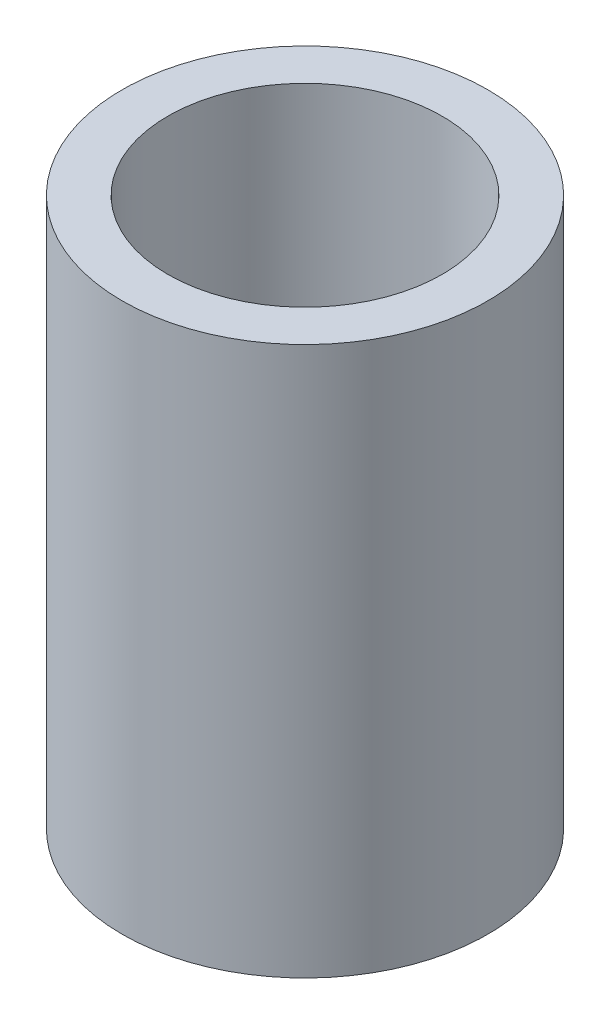
ISO-10303-21;
HEADER;
FILE_DESCRIPTION(('STEP AP214'),'2;1');
FILE_NAME('part.step','',(''),(''),'','','');
FILE_SCHEMA(('AUTOMOTIVE_DESIGN { 1 0 10303 214 1 1 1 1 }'));
ENDSEC;
DATA;
#1=APPLICATION_CONTEXT('core data for automotive mechanical design processes');
#2=APPLICATION_PROTOCOL_DEFINITION('international standard','automotive_design',2000,#1);
#3=PRODUCT_CONTEXT('',#1,'mechanical');
#4=PRODUCT('Part','Part','',(#3));
#5=PRODUCT_RELATED_PRODUCT_CATEGORY('part','',(#4));
#6=PRODUCT_DEFINITION_FORMATION('','',#4);
#7=PRODUCT_DEFINITION_CONTEXT('part definition',#1,'design');
#8=PRODUCT_DEFINITION('design','',#6,#7);
#9=PRODUCT_DEFINITION_SHAPE('','',#8);
#10=(LENGTH_UNIT() NAMED_UNIT(*) SI_UNIT(.MILLI.,.METRE.));
#11=(NAMED_UNIT(*) PLANE_ANGLE_UNIT() SI_UNIT($,.RADIAN.));
#12=(NAMED_UNIT(*) SI_UNIT($,.STERADIAN.) SOLID_ANGLE_UNIT());
#13=UNCERTAINTY_MEASURE_WITH_UNIT(LENGTH_MEASURE(1.E-05),#10,'distance_accuracy_value','');
#14=(GEOMETRIC_REPRESENTATION_CONTEXT(3) GLOBAL_UNCERTAINTY_ASSIGNED_CONTEXT((#13)) GLOBAL_UNIT_ASSIGNED_CONTEXT((#10,
#11,#12)) REPRESENTATION_CONTEXT('',''));
#15=CARTESIAN_POINT('',(0.,0.,0.));
#16=DIRECTION('',(0.,0.,1.));
#17=DIRECTION('',(1.,0.,0.));
#18=AXIS2_PLACEMENT_3D('',#15,#16,#17);
#19=CARTESIAN_POINT('',(0.,38.1,0.));
#20=DIRECTION('',(0.,1.,0.));
#21=DIRECTION('',(0.,0.,1.));
#22=AXIS2_PLACEMENT_3D('',#19,#20,#21);
#23=PLANE('',#22);
#24=CARTESIAN_POINT('',(0.,38.1,0.));
#25=DIRECTION('',(0.,1.,0.));
#26=DIRECTION('',(0.,0.,1.));
#27=AXIS2_PLACEMENT_3D('',#24,#25,#26);
#28=CIRCLE('',#27,12.7);
#29=CARTESIAN_POINT('',(0.,38.1,12.7));
#30=VERTEX_POINT('',#29);
#31=EDGE_CURVE('E10',#30,#30,#28,.T.);
#32=ORIENTED_EDGE('',*,*,#31,.T.);
#33=EDGE_LOOP('',(#32));
#34=FACE_BOUND('',#33,.T.);
#35=CARTESIAN_POINT('',(0.,38.1,0.));
#36=DIRECTION('',(0.,1.,0.));
#37=DIRECTION('',(0.,0.,1.));
#38=AXIS2_PLACEMENT_3D('',#35,#36,#37);
#39=CIRCLE('',#38,9.52500000000002);
#40=CARTESIAN_POINT('',(0.,38.1,9.52500000000002));
#41=VERTEX_POINT('',#40);
#42=EDGE_CURVE('E43',#41,#41,#39,.T.);
#43=ORIENTED_EDGE('',*,*,#42,.F.);
#44=EDGE_LOOP('',(#43));
#45=FACE_BOUND('',#44,.T.);
#46=ADVANCED_FACE('F32',(#34,#45),#23,.T.);
#47=CARTESIAN_POINT('',(0.,0.,0.));
#48=DIRECTION('',(0.,1.,0.));
#49=DIRECTION('',(0.,0.,1.));
#50=AXIS2_PLACEMENT_3D('',#47,#48,#49);
#51=PLANE('',#50);
#52=CARTESIAN_POINT('',(0.,0.,0.));
#53=DIRECTION('',(0.,1.,0.));
#54=DIRECTION('',(0.,0.,1.));
#55=AXIS2_PLACEMENT_3D('',#52,#53,#54);
#56=CIRCLE('',#55,12.7);
#57=CARTESIAN_POINT('',(0.,0.,12.7));
#58=VERTEX_POINT('',#57);
#59=EDGE_CURVE('E36',#58,#58,#56,.T.);
#60=ORIENTED_EDGE('',*,*,#59,.F.);
#61=EDGE_LOOP('',(#60));
#62=FACE_BOUND('',#61,.T.);
#63=CARTESIAN_POINT('',(0.,0.,0.));
#64=DIRECTION('',(0.,1.,0.));
#65=DIRECTION('',(0.,0.,1.));
#66=AXIS2_PLACEMENT_3D('',#63,#64,#65);
#67=CIRCLE('',#66,9.52500000000002);
#68=CARTESIAN_POINT('',(0.,0.,9.52500000000002));
#69=VERTEX_POINT('',#68);
#70=EDGE_CURVE('E45',#69,#69,#67,.T.);
#71=ORIENTED_EDGE('',*,*,#70,.T.);
#72=EDGE_LOOP('',(#71));
#73=FACE_BOUND('',#72,.T.);
#74=ADVANCED_FACE('F55',(#62,#73),#51,.F.);
#75=CARTESIAN_POINT('',(0.,38.1,0.));
#76=DIRECTION('',(0.,-1.,0.));
#77=DIRECTION('',(0.,0.,-1.));
#78=AXIS2_PLACEMENT_3D('',#75,#76,#77);
#79=CYLINDRICAL_SURFACE('',#78,12.7);
#80=ORIENTED_EDGE('',*,*,#31,.F.);
#81=EDGE_LOOP('',(#80));
#82=FACE_BOUND('',#81,.T.);
#83=ORIENTED_EDGE('',*,*,#59,.T.);
#84=EDGE_LOOP('',(#83));
#85=FACE_BOUND('',#84,.T.);
#86=ADVANCED_FACE('F34',(#82,#85),#79,.T.);
#87=CARTESIAN_POINT('',(0.,38.1,0.));
#88=DIRECTION('',(0.,-1.,0.));
#89=DIRECTION('',(0.,0.,-1.));
#90=AXIS2_PLACEMENT_3D('',#87,#88,#89);
#91=CYLINDRICAL_SURFACE('',#90,9.52500000000002);
#92=ORIENTED_EDGE('',*,*,#42,.T.);
#93=EDGE_LOOP('',(#92));
#94=FACE_BOUND('',#93,.T.);
#95=ORIENTED_EDGE('',*,*,#70,.F.);
#96=EDGE_LOOP('',(#95));
#97=FACE_BOUND('',#96,.T.);
#98=ADVANCED_FACE('F51',(#94,#97),#91,.F.);
#99=CLOSED_SHELL('',(#46,#74,#86,#98));
#100=MANIFOLD_SOLID_BREP('B2',#99);
#101=ADVANCED_BREP_SHAPE_REPRESENTATION('',(#18,#100),#14);
#102=SHAPE_DEFINITION_REPRESENTATION(#9,#101);
ENDSEC;
END-ISO-10303-21;
